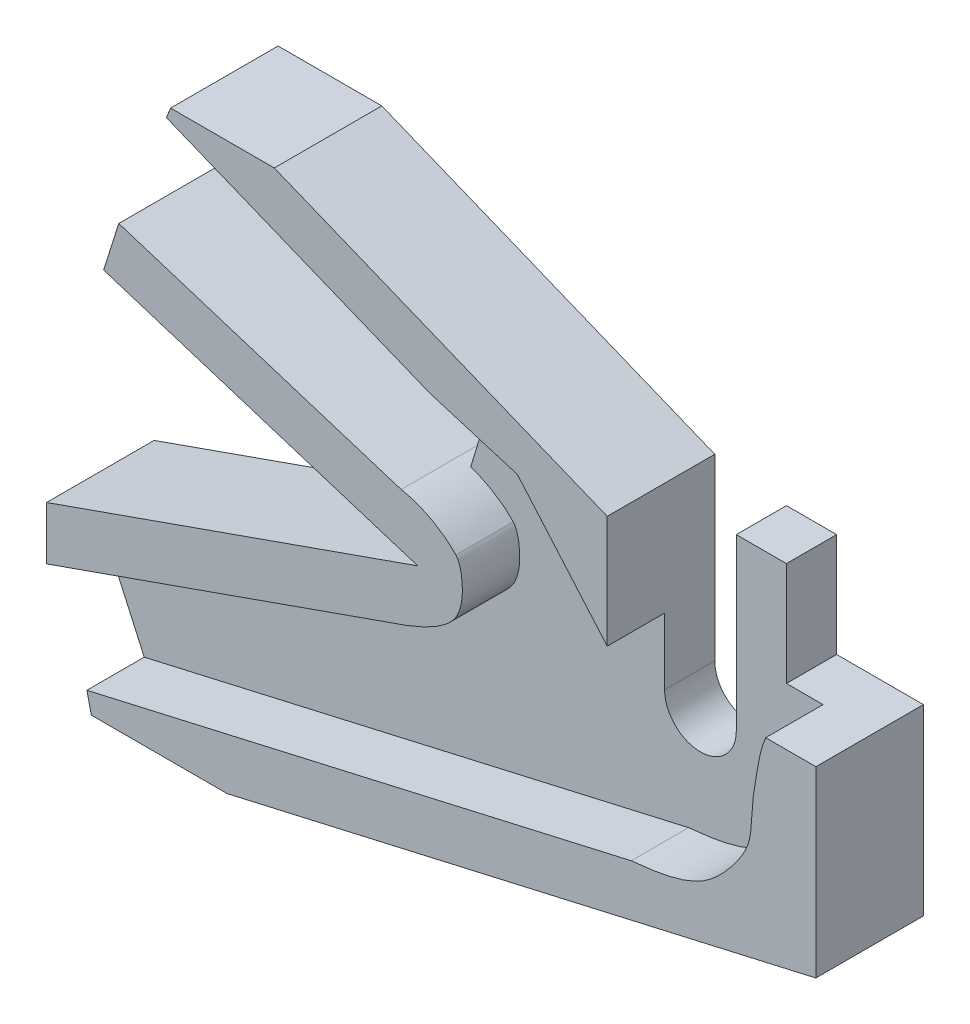
ISO-10303-21;
HEADER;
FILE_DESCRIPTION(('STEP AP214'),'2;1');
FILE_NAME('part.step','',(''),(''),'','','');
FILE_SCHEMA(('AUTOMOTIVE_DESIGN { 1 0 10303 214 1 1 1 1 }'));
ENDSEC;
DATA;
#1=APPLICATION_CONTEXT('core data for automotive mechanical design processes');
#2=APPLICATION_PROTOCOL_DEFINITION('international standard','automotive_design',2000,#1);
#3=PRODUCT_CONTEXT('',#1,'mechanical');
#4=PRODUCT('Part','Part','',(#3));
#5=PRODUCT_RELATED_PRODUCT_CATEGORY('part','',(#4));
#6=PRODUCT_DEFINITION_FORMATION('','',#4);
#7=PRODUCT_DEFINITION_CONTEXT('part definition',#1,'design');
#8=PRODUCT_DEFINITION('design','',#6,#7);
#9=PRODUCT_DEFINITION_SHAPE('','',#8);
#10=(LENGTH_UNIT() NAMED_UNIT(*) SI_UNIT(.MILLI.,.METRE.));
#11=(NAMED_UNIT(*) PLANE_ANGLE_UNIT() SI_UNIT($,.RADIAN.));
#12=(NAMED_UNIT(*) SI_UNIT($,.STERADIAN.) SOLID_ANGLE_UNIT());
#13=UNCERTAINTY_MEASURE_WITH_UNIT(LENGTH_MEASURE(1.E-05),#10,'distance_accuracy_value','');
#14=(GEOMETRIC_REPRESENTATION_CONTEXT(3) GLOBAL_UNCERTAINTY_ASSIGNED_CONTEXT((#13)) GLOBAL_UNIT_ASSIGNED_CONTEXT((#10,
#11,#12)) REPRESENTATION_CONTEXT('',''));
#15=CARTESIAN_POINT('',(0.,0.,0.));
#16=DIRECTION('',(0.,0.,1.));
#17=DIRECTION('',(1.,0.,0.));
#18=AXIS2_PLACEMENT_3D('',#15,#16,#17);
#19=CARTESIAN_POINT('',(0.,0.,7.));
#20=DIRECTION('',(0.,0.,1.));
#21=DIRECTION('',(1.,0.,0.));
#22=AXIS2_PLACEMENT_3D('',#19,#20,#21);
#23=PLANE('',#22);
#24=CARTESIAN_POINT('',(114.251338293482,139.122057434541,7.));
#25=CARTESIAN_POINT('',(117.630269235792,139.451745498885,7.));
#26=CARTESIAN_POINT('',(123.500637096052,140.17650562535,7.));
#27=CARTESIAN_POINT('',(128.302839898139,145.268019155865,7.));
#28=CARTESIAN_POINT('',(131.110589528849,149.496362437343,7.));
#29=CARTESIAN_POINT('',(130.976085883031,154.112704048557,7.));
#30=CARTESIAN_POINT('',(131.81351493928,158.698679076612,7.));
#31=CARTESIAN_POINT('',(132.292264245439,161.793379253052,7.));
#32=CARTESIAN_POINT('',(133.003068168719,163.363718021564,7.));
#33=B_SPLINE_CURVE_WITH_KNOTS('',3,(#24,#25,#26,#27,#28,#29,#30,#31,#32),.UNSPECIFIED.,.F.,.F.,
(4,1,1,1,1,1,4),(0.,0.304997778392759,0.465583156579805,0.594531521816844,0.730666825485798,
0.852303270571424,1.),.UNSPECIFIED.);
#34=CARTESIAN_POINT('',(133.003068168719,163.363718021564,7.));
#35=VERTEX_POINT('',#34);
#36=CARTESIAN_POINT('',(114.251338293482,139.122057434541,7.));
#37=VERTEX_POINT('',#36);
#38=EDGE_CURVE('E409',#35,#37,#33,.F.);
#39=ORIENTED_EDGE('',*,*,#38,.F.);
#40=DIRECTION('',(1.,0.,0.));
#41=VECTOR('',#40,1.);
#42=CARTESIAN_POINT('',(0.,163.363718021564,7.));
#43=LINE('',#42,#41);
#44=CARTESIAN_POINT('',(127.895456025362,163.363718021564,7.));
#45=VERTEX_POINT('',#44);
#46=EDGE_CURVE('E668',#45,#35,#43,.T.);
#47=ORIENTED_EDGE('',*,*,#46,.F.);
#48=DIRECTION('',(0.,-1.,0.));
#49=VECTOR('',#48,1.);
#50=CARTESIAN_POINT('',(127.895456025362,0.,7.));
#51=LINE('',#50,#49);
#52=CARTESIAN_POINT('',(127.895456025362,177.847108131035,7.));
#53=VERTEX_POINT('',#52);
#54=EDGE_CURVE('E672',#53,#45,#51,.T.);
#55=ORIENTED_EDGE('',*,*,#54,.F.);
#56=DIRECTION('',(1.,0.,0.));
#57=VECTOR('',#56,1.);
#58=CARTESIAN_POINT('',(0.,177.847108131035,7.));
#59=LINE('',#58,#57);
#60=CARTESIAN_POINT('',(120.895456025362,177.847108131035,7.));
#61=VERTEX_POINT('',#60);
#62=EDGE_CURVE('E676',#61,#53,#59,.T.);
#63=ORIENTED_EDGE('',*,*,#62,.F.);
#64=DIRECTION('',(0.,-1.,0.));
#65=VECTOR('',#64,1.);
#66=CARTESIAN_POINT('',(120.895456025362,0.,7.));
#67=LINE('',#66,#65);
#68=CARTESIAN_POINT('',(120.895456025362,154.100245398849,7.));
#69=VERTEX_POINT('',#68);
#70=EDGE_CURVE('E680',#61,#69,#67,.T.);
#71=ORIENTED_EDGE('',*,*,#70,.T.);
#72=CARTESIAN_POINT('',(115.895456025362,154.100245398849,7.));
#73=DIRECTION('',(0.,0.,1.));
#74=DIRECTION('',(1.,0.,0.));
#75=AXIS2_PLACEMENT_3D('',#72,#73,#74);
#76=CIRCLE('',#75,5.00000000000001);
#77=CARTESIAN_POINT('',(110.895456025362,154.100245398849,7.));
#78=VERTEX_POINT('',#77);
#79=EDGE_CURVE('E683',#78,#69,#76,.T.);
#80=ORIENTED_EDGE('',*,*,#79,.F.);
#81=DIRECTION('',(0.,1.,0.));
#82=VECTOR('',#81,1.);
#83=CARTESIAN_POINT('',(110.895456025362,0.,7.));
#84=LINE('',#83,#82);
#85=CARTESIAN_POINT('',(110.895456025362,163.363718021564,7.));
#86=VERTEX_POINT('',#85);
#87=EDGE_CURVE('E687',#78,#86,#84,.T.);
#88=ORIENTED_EDGE('',*,*,#87,.T.);
#89=DIRECTION('',(-0.654208958328494,0.756313849432064,0.));
#90=VECTOR('',#89,1.);
#91=CARTESIAN_POINT('',(144.263672885915,124.787596094146,7.));
#92=LINE('',#91,#90);
#93=CARTESIAN_POINT('',(98.3673718659907,177.847108131035,7.));
#94=VERTEX_POINT('',#93);
#95=EDGE_CURVE('E498',#86,#94,#92,.T.);
#96=ORIENTED_EDGE('',*,*,#95,.T.);
#97=DIRECTION('',(-0.956955139782985,0.290235870358795,0.));
#98=VECTOR('',#97,1.);
#99=CARTESIAN_POINT('',(57.6818959785968,190.186646333231,7.));
#100=LINE('',#99,#98);
#101=CARTESIAN_POINT('',(87.9461166445004,181.007780929267,7.));
#102=VERTEX_POINT('',#101);
#103=EDGE_CURVE('E502',#94,#102,#100,.T.);
#104=ORIENTED_EDGE('',*,*,#103,.T.);
#105=DIRECTION('',(0.290235870358796,0.956955139782985,0.));
#106=VECTOR('',#105,1.);
#107=CARTESIAN_POINT('',(30.2642206659035,-9.17886540396356,7.));
#108=LINE('',#107,#106);
#109=CARTESIAN_POINT('',(83.8500527942316,167.502388403015,7.));
#110=VERTEX_POINT('',#109);
#111=EDGE_CURVE('E659',#110,#102,#108,.T.);
#112=ORIENTED_EDGE('',*,*,#111,.F.);
#113=CARTESIAN_POINT('',(89.7840653023184,163.822842658835,7.));
#114=CARTESIAN_POINT('',(89.3163299489595,164.268991094698,7.));
#115=CARTESIAN_POINT('',(88.7283822379727,164.883230811065,7.));
#116=CARTESIAN_POINT('',(87.4686049663665,165.75600214993,7.));
#117=CARTESIAN_POINT('',(86.0540993608297,166.664417976423,7.));
#118=CARTESIAN_POINT('',(84.5544661102407,167.244470402787,7.));
#119=CARTESIAN_POINT('',(83.4087406485989,167.666166331298,7.));
#120=CARTESIAN_POINT('',(82.6000325140046,167.827100908995,7.));
#121=CARTESIAN_POINT('',(82.1516733766683,167.921017401913,7.));
#122=B_SPLINE_CURVE_WITH_KNOTS('',3,(#113,#114,#115,#116,#117,#118,#119,#120,#121),
.UNSPECIFIED.,.F.,.F.,(4,1,1,1,1,1,4),(0.,0.219202804866936,0.269709764380204,0.505069595132677,
0.769616283167278,0.819109323654011,1.),.UNSPECIFIED.);
#123=CARTESIAN_POINT('',(89.7840653023184,163.822842658835,7.));
#124=VERTEX_POINT('',#123);
#125=EDGE_CURVE('E697',#110,#124,#122,.F.);
#126=ORIENTED_EDGE('',*,*,#125,.T.);
#127=CARTESIAN_POINT('',(79.225262092158,150.588845560685,7.));
#128=CARTESIAN_POINT('',(82.7046243559138,151.726727244382,7.));
#129=CARTESIAN_POINT('',(85.4752498126349,152.810317387559,7.));
#130=CARTESIAN_POINT('',(88.1909730080847,154.560214514461,7.));
#131=CARTESIAN_POINT('',(89.2301936255335,155.455562887182,7.));
#132=CARTESIAN_POINT('',(90.3085174006555,157.110254117227,7.));
#133=CARTESIAN_POINT('',(90.7141098676327,158.947185872426,7.));
#134=CARTESIAN_POINT('',(90.6377143369345,162.884305981463,7.));
#135=CARTESIAN_POINT('',(89.9243233059966,163.657833242743,7.));
#136=CARTESIAN_POINT('',(89.7840653023184,163.822842658835,7.));
#137=B_SPLINE_CURVE_WITH_KNOTS('',3,(#127,#128,#129,#130,#131,#132,#133,#134,#135,#136),
.UNSPECIFIED.,.F.,.F.,(4,1,1,1,1,1,1,4),(0.,0.252456108640945,0.293916012906438,
0.401189817127325,0.430118649039364,0.554275500114791,0.612815595849297,1.),.UNSPECIFIED.);
#138=CARTESIAN_POINT('',(79.225262092158,150.588845560685,7.));
#139=VERTEX_POINT('',#138);
#140=EDGE_CURVE('E879',#124,#139,#137,.F.);
#141=ORIENTED_EDGE('',*,*,#140,.T.);
#142=DIRECTION('',(0.94323670859298,0.332121230219753,0.));
#143=VECTOR('',#142,1.);
#144=CARTESIAN_POINT('',(-38.43590359074,109.159402940723,7.));
#145=LINE('',#144,#143);
#146=CARTESIAN_POINT('',(32.6823451226157,134.20071021659,7.));
#147=VERTEX_POINT('',#146);
#148=EDGE_CURVE('E871',#147,#139,#145,.T.);
#149=ORIENTED_EDGE('',*,*,#148,.F.);
#150=DIRECTION('',(-0.411644510354824,0.911344499678764,0.));
#151=VECTOR('',#150,1.);
#152=CARTESIAN_POINT('',(77.489673542484,35.0012522533407,7.));
#153=LINE('',#152,#151);
#154=CARTESIAN_POINT('',(38.3074852622428,121.747147987007,7.));
#155=VERTEX_POINT('',#154);
#156=EDGE_CURVE('E661',#155,#147,#153,.T.);
#157=ORIENTED_EDGE('',*,*,#156,.F.);
#158=DIRECTION('',(-0.974812997221088,-0.223023811394298,0.));
#159=VECTOR('',#158,1.);
#160=CARTESIAN_POINT('',(-24.5632227735133,107.363194376248,7.));
#161=LINE('',#160,#159);
#162=EDGE_CURVE('E414',#37,#155,#161,.T.);
#163=ORIENTED_EDGE('',*,*,#162,.F.);
#164=EDGE_LOOP('',(#39,#47,#55,#63,#71,#80,#88,#96,#104,#112,#126,#141,#149,#157,#163));
#165=FACE_BOUND('',#164,.T.);
#166=ADVANCED_FACE('F203',(#165),#23,.T.);
#167=CARTESIAN_POINT('',(30.2642206659035,-9.17886540396356,7.));
#168=DIRECTION('',(-0.956955139782985,0.290235870358796,0.));
#169=DIRECTION('',(-0.290235870358796,-0.956955139782985,0.));
#170=AXIS2_PLACEMENT_3D('',#167,#168,#169);
#171=PLANE('',#170);
#172=DIRECTION('',(0.290235870358796,0.956955139782985,0.));
#173=VECTOR('',#172,1.);
#174=CARTESIAN_POINT('',(30.2642206659035,-9.17886540396356,0.));
#175=LINE('',#174,#173);
#176=CARTESIAN_POINT('',(83.8500527942316,167.502388403015,0.));
#177=VERTEX_POINT('',#176);
#178=CARTESIAN_POINT('',(87.9461166445004,181.007780929267,0.));
#179=VERTEX_POINT('',#178);
#180=EDGE_CURVE('E692',#177,#179,#175,.T.);
#181=ORIENTED_EDGE('',*,*,#180,.F.);
#182=DIRECTION('',(0.,0.,-1.));
#183=VECTOR('',#182,1.);
#184=CARTESIAN_POINT('',(83.8500527942316,167.502388403015,7.));
#185=LINE('',#184,#183);
#186=EDGE_CURVE('E12',#110,#177,#185,.T.);
#187=ORIENTED_EDGE('',*,*,#186,.F.);
#188=ORIENTED_EDGE('',*,*,#111,.T.);
#189=DIRECTION('',(0.,0.,-1.));
#190=VECTOR('',#189,1.);
#191=CARTESIAN_POINT('',(87.9461166445004,181.007780929267,7.));
#192=LINE('',#191,#190);
#193=EDGE_CURVE('E691',#102,#179,#192,.T.);
#194=ORIENTED_EDGE('',*,*,#193,.T.);
#195=EDGE_LOOP('',(#181,#187,#188,#194));
#196=FACE_BOUND('',#195,.T.);
#197=ADVANCED_FACE('F205',(#196),#171,.T.);
#198=CARTESIAN_POINT('',(89.7840653023184,163.822842658835,7.));
#199=CARTESIAN_POINT('',(89.3163299489595,164.268991094698,7.));
#200=CARTESIAN_POINT('',(88.7283822379727,164.883230811065,7.));
#201=CARTESIAN_POINT('',(87.4686049663665,165.75600214993,7.));
#202=CARTESIAN_POINT('',(86.0540993608297,166.664417976423,7.));
#203=CARTESIAN_POINT('',(84.5544661102407,167.244470402787,7.));
#204=CARTESIAN_POINT('',(83.4087406485989,167.666166331298,7.));
#205=CARTESIAN_POINT('',(82.6000325140046,167.827100908995,7.));
#206=CARTESIAN_POINT('',(82.1516733766683,167.921017401913,7.));
#207=B_SPLINE_CURVE_WITH_KNOTS('',3,(#198,#199,#200,#201,#202,#203,#204,#205,#206),
.UNSPECIFIED.,.F.,.F.,(4,1,1,1,1,1,4),(0.,0.219202804866936,0.269709764380204,0.505069595132677,
0.769616283167278,0.819109323654011,1.),.UNSPECIFIED.);
#208=DIRECTION('',(0.,0.,-1.));
#209=VECTOR('',#208,1.);
#210=SURFACE_OF_LINEAR_EXTRUSION('',#207,#209);
#211=CARTESIAN_POINT('',(89.7840653023184,163.822842658835,0.));
#212=CARTESIAN_POINT('',(89.3163299489595,164.268991094698,0.));
#213=CARTESIAN_POINT('',(88.7283822379727,164.883230811065,0.));
#214=CARTESIAN_POINT('',(87.4686049663665,165.75600214993,0.));
#215=CARTESIAN_POINT('',(86.0540993608297,166.664417976423,0.));
#216=CARTESIAN_POINT('',(84.5544661102407,167.244470402787,0.));
#217=CARTESIAN_POINT('',(83.4087406485989,167.666166331298,0.));
#218=CARTESIAN_POINT('',(82.6000325140046,167.827100908995,0.));
#219=CARTESIAN_POINT('',(82.1516733766683,167.921017401913,0.));
#220=B_SPLINE_CURVE_WITH_KNOTS('',3,(#211,#212,#213,#214,#215,#216,#217,#218,#219),
.UNSPECIFIED.,.F.,.F.,(4,1,1,1,1,1,4),(0.,0.219202804866936,0.269709764380204,0.505069595132677,
0.769616283167278,0.819109323654011,1.),.UNSPECIFIED.);
#221=CARTESIAN_POINT('',(82.1516733766683,167.921017401913,0.));
#222=VERTEX_POINT('',#221);
#223=EDGE_CURVE('E696',#177,#222,#220,.T.);
#224=ORIENTED_EDGE('',*,*,#223,.T.);
#225=DIRECTION('',(0.,0.,-1.));
#226=VECTOR('',#225,1.);
#227=CARTESIAN_POINT('',(82.1516733766683,167.921017401913,7.));
#228=LINE('',#227,#226);
#229=CARTESIAN_POINT('',(82.1516733766683,167.921017401913,15.));
#230=VERTEX_POINT('',#229);
#231=EDGE_CURVE('E213',#230,#222,#228,.T.);
#232=ORIENTED_EDGE('',*,*,#231,.F.);
#233=CARTESIAN_POINT('',(89.7840653023184,163.822842658835,15.));
#234=CARTESIAN_POINT('',(89.3163299489595,164.268991094698,15.));
#235=CARTESIAN_POINT('',(88.7283822379727,164.883230811065,15.));
#236=CARTESIAN_POINT('',(87.4686049663665,165.75600214993,15.));
#237=CARTESIAN_POINT('',(86.0540993608297,166.664417976423,15.));
#238=CARTESIAN_POINT('',(84.5544661102407,167.244470402787,15.));
#239=CARTESIAN_POINT('',(83.4087406485989,167.666166331298,15.));
#240=CARTESIAN_POINT('',(82.6000325140046,167.827100908995,15.));
#241=CARTESIAN_POINT('',(82.1516733766683,167.921017401913,15.));
#242=B_SPLINE_CURVE_WITH_KNOTS('',3,(#233,#234,#235,#236,#237,#238,#239,#240,#241),
.UNSPECIFIED.,.F.,.F.,(4,1,1,1,1,1,4),(0.,0.219202804866936,0.269709764380204,0.505069595132677,
0.769616283167278,0.819109323654011,1.),.UNSPECIFIED.);
#243=CARTESIAN_POINT('',(89.7840653023184,163.822842658835,15.));
#244=VERTEX_POINT('',#243);
#245=EDGE_CURVE('E505',#244,#230,#242,.T.);
#246=ORIENTED_EDGE('',*,*,#245,.F.);
#247=DIRECTION('',(0.,0.,-1.));
#248=VECTOR('',#247,1.);
#249=CARTESIAN_POINT('',(89.7840653023184,163.822842658835,15.));
#250=LINE('',#249,#248);
#251=EDGE_CURVE('E544',#244,#124,#250,.T.);
#252=ORIENTED_EDGE('',*,*,#251,.T.);
#253=ORIENTED_EDGE('',*,*,#125,.F.);
#254=ORIENTED_EDGE('',*,*,#186,.T.);
#255=EDGE_LOOP('',(#224,#232,#246,#252,#253,#254));
#256=FACE_BOUND('',#255,.T.);
#257=ADVANCED_FACE('F649',(#256),#210,.F.);
#258=CARTESIAN_POINT('',(55.6675821364115,176.284245333248,7.));
#259=DIRECTION('',(0.301125824816119,0.953584415575681,0.));
#260=DIRECTION('',(-0.953584415575681,0.301125824816119,0.));
#261=AXIS2_PLACEMENT_3D('',#258,#259,#260);
#262=PLANE('',#261);
#263=DIRECTION('',(0.953584415575681,-0.301125824816119,0.));
#264=VECTOR('',#263,1.);
#265=CARTESIAN_POINT('',(55.6675821364115,176.284245333248,0.));
#266=LINE('',#265,#264);
#267=CARTESIAN_POINT('',(42.7520398931628,180.362755056582,0.));
#268=VERTEX_POINT('',#267);
#269=EDGE_CURVE('E703',#268,#222,#266,.T.);
#270=ORIENTED_EDGE('',*,*,#269,.F.);
#271=DIRECTION('',(0.,0.,-1.));
#272=VECTOR('',#271,1.);
#273=CARTESIAN_POINT('',(42.7520398931628,180.362755056582,7.));
#274=LINE('',#273,#272);
#275=CARTESIAN_POINT('',(42.7520398931628,180.362755056582,15.));
#276=VERTEX_POINT('',#275);
#277=EDGE_CURVE('E849',#276,#268,#274,.T.);
#278=ORIENTED_EDGE('',*,*,#277,.F.);
#279=DIRECTION('',(0.953584415575681,-0.301125824816119,0.));
#280=VECTOR('',#279,1.);
#281=CARTESIAN_POINT('',(55.6675821364115,176.284245333248,15.));
#282=LINE('',#281,#280);
#283=EDGE_CURVE('E511',#276,#230,#282,.T.);
#284=ORIENTED_EDGE('',*,*,#283,.T.);
#285=ORIENTED_EDGE('',*,*,#231,.T.);
#286=EDGE_LOOP('',(#270,#278,#284,#285));
#287=FACE_BOUND('',#286,.T.);
#288=ADVANCED_FACE('F646',(#287),#262,.T.);
#289=CARTESIAN_POINT('',(-12.9155422432485,4.07850972333446,7.));
#290=DIRECTION('',(0.953584415575681,-0.301125824816118,0.));
#291=DIRECTION('',(0.301125824816118,0.953584415575681,0.));
#292=AXIS2_PLACEMENT_3D('',#289,#290,#291);
#293=PLANE('',#292);
#294=DIRECTION('',(-0.301125824816118,-0.953584415575681,0.));
#295=VECTOR('',#294,1.);
#296=CARTESIAN_POINT('',(-12.9155422432485,4.07850972333446,0.));
#297=LINE('',#296,#295);
#298=CARTESIAN_POINT('',(40.64415911945,173.687664147552,0.));
#299=VERTEX_POINT('',#298);
#300=EDGE_CURVE('E710',#268,#299,#297,.T.);
#301=ORIENTED_EDGE('',*,*,#300,.T.);
#302=DIRECTION('',(0.,0.,-1.));
#303=VECTOR('',#302,1.);
#304=CARTESIAN_POINT('',(40.64415911945,173.687664147552,7.));
#305=LINE('',#304,#303);
#306=CARTESIAN_POINT('',(40.64415911945,173.687664147552,15.));
#307=VERTEX_POINT('',#306);
#308=EDGE_CURVE('E845',#307,#299,#305,.T.);
#309=ORIENTED_EDGE('',*,*,#308,.F.);
#310=DIRECTION('',(-0.301125824816118,-0.953584415575681,0.));
#311=VECTOR('',#310,1.);
#312=CARTESIAN_POINT('',(-12.9155422432485,4.07850972333446,15.));
#313=LINE('',#312,#311);
#314=EDGE_CURVE('E518',#276,#307,#313,.T.);
#315=ORIENTED_EDGE('',*,*,#314,.F.);
#316=ORIENTED_EDGE('',*,*,#277,.T.);
#317=EDGE_LOOP('',(#301,#309,#315,#316));
#318=FACE_BOUND('',#317,.T.);
#319=ADVANCED_FACE('F642',(#318),#293,.F.);
#320=CARTESIAN_POINT('',(53.5597013626985,169.609154424218,7.));
#321=DIRECTION('',(0.301125824816118,0.953584415575681,0.));
#322=DIRECTION('',(-0.953584415575681,0.301125824816118,0.));
#323=AXIS2_PLACEMENT_3D('',#320,#321,#322);
#324=PLANE('',#323);
#325=DIRECTION('',(0.953584415575681,-0.301125824816118,0.));
#326=VECTOR('',#325,1.);
#327=CARTESIAN_POINT('',(53.5597013626985,169.609154424218,0.));
#328=LINE('',#327,#326);
#329=CARTESIAN_POINT('',(84.4571090931259,159.852275813856,0.));
#330=VERTEX_POINT('',#329);
#331=EDGE_CURVE('E713',#299,#330,#328,.T.);
#332=ORIENTED_EDGE('',*,*,#331,.T.);
#333=DIRECTION('',(0.,0.,-1.));
#334=VECTOR('',#333,1.);
#335=CARTESIAN_POINT('',(84.4571090931259,159.852275813856,7.));
#336=LINE('',#335,#334);
#337=CARTESIAN_POINT('',(84.4571090931259,159.852275813856,15.));
#338=VERTEX_POINT('',#337);
#339=EDGE_CURVE('E842',#338,#330,#336,.T.);
#340=ORIENTED_EDGE('',*,*,#339,.F.);
#341=DIRECTION('',(0.953584415575681,-0.301125824816118,0.));
#342=VECTOR('',#341,1.);
#343=CARTESIAN_POINT('',(53.5597013626985,169.609154424218,15.));
#344=LINE('',#343,#342);
#345=EDGE_CURVE('E522',#307,#338,#344,.T.);
#346=ORIENTED_EDGE('',*,*,#345,.F.);
#347=ORIENTED_EDGE('',*,*,#308,.T.);
#348=EDGE_LOOP('',(#332,#340,#346,#347));
#349=FACE_BOUND('',#348,.T.);
#350=ADVANCED_FACE('F638',(#349),#324,.F.);
#351=CARTESIAN_POINT('',(-40.7607522022779,115.762059900873,7.));
#352=DIRECTION('',(-0.332121230219753,0.94323670859298,0.));
#353=DIRECTION('',(-0.94323670859298,-0.332121230219753,0.));
#354=AXIS2_PLACEMENT_3D('',#351,#352,#353);
#355=PLANE('',#354);
#356=DIRECTION('',(0.94323670859298,0.332121230219753,0.));
#357=VECTOR('',#356,1.);
#358=CARTESIAN_POINT('',(-40.7607522022779,115.762059900873,0.));
#359=LINE('',#358,#357);
#360=CARTESIAN_POINT('',(32.6823451226157,141.621965068345,0.));
#361=VERTEX_POINT('',#360);
#362=EDGE_CURVE('E717',#361,#330,#359,.T.);
#363=ORIENTED_EDGE('',*,*,#362,.F.);
#364=DIRECTION('',(0.,0.,-1.));
#365=VECTOR('',#364,1.);
#366=CARTESIAN_POINT('',(32.6823451226157,141.621965068345,7.));
#367=LINE('',#366,#365);
#368=CARTESIAN_POINT('',(32.6823451226157,141.621965068345,15.));
#369=VERTEX_POINT('',#368);
#370=EDGE_CURVE('E839',#369,#361,#367,.T.);
#371=ORIENTED_EDGE('',*,*,#370,.F.);
#372=DIRECTION('',(0.94323670859298,0.332121230219753,0.));
#373=VECTOR('',#372,1.);
#374=CARTESIAN_POINT('',(-40.7607522022779,115.762059900873,15.));
#375=LINE('',#374,#373);
#376=EDGE_CURVE('E526',#369,#338,#375,.T.);
#377=ORIENTED_EDGE('',*,*,#376,.T.);
#378=ORIENTED_EDGE('',*,*,#339,.T.);
#379=EDGE_LOOP('',(#363,#371,#377,#378));
#380=FACE_BOUND('',#379,.T.);
#381=ADVANCED_FACE('F634',(#380),#355,.T.);
#382=CARTESIAN_POINT('',(32.6823451226157,0.,7.));
#383=DIRECTION('',(-1.,0.,0.));
#384=DIRECTION('',(0.,0.,1.));
#385=AXIS2_PLACEMENT_3D('',#382,#383,#384);
#386=PLANE('',#385);
#387=DIRECTION('',(0.,1.,0.));
#388=VECTOR('',#387,1.);
#389=CARTESIAN_POINT('',(32.6823451226157,0.,0.));
#390=LINE('',#389,#388);
#391=CARTESIAN_POINT('',(32.6823451226157,134.20071021659,0.));
#392=VERTEX_POINT('',#391);
#393=EDGE_CURVE('E721',#392,#361,#390,.T.);
#394=ORIENTED_EDGE('',*,*,#393,.F.);
#395=DIRECTION('',(0.,0.,-1.));
#396=VECTOR('',#395,1.);
#397=CARTESIAN_POINT('',(32.6823451226157,134.20071021659,7.));
#398=LINE('',#397,#396);
#399=EDGE_CURVE('E836',#147,#392,#398,.T.);
#400=ORIENTED_EDGE('',*,*,#399,.F.);
#401=DIRECTION('',(0.,0.,-1.));
#402=VECTOR('',#401,1.);
#403=CARTESIAN_POINT('',(32.6823451226157,134.20071021659,15.));
#404=LINE('',#403,#402);
#405=CARTESIAN_POINT('',(32.6823451226157,134.20071021659,15.));
#406=VERTEX_POINT('',#405);
#407=EDGE_CURVE('E868',#406,#147,#404,.T.);
#408=ORIENTED_EDGE('',*,*,#407,.F.);
#409=DIRECTION('',(0.,1.,0.));
#410=VECTOR('',#409,1.);
#411=CARTESIAN_POINT('',(32.6823451226157,0.,15.));
#412=LINE('',#411,#410);
#413=EDGE_CURVE('E530',#406,#369,#412,.T.);
#414=ORIENTED_EDGE('',*,*,#413,.T.);
#415=ORIENTED_EDGE('',*,*,#370,.T.);
#416=EDGE_LOOP('',(#394,#400,#408,#414,#415));
#417=FACE_BOUND('',#416,.T.);
#418=ADVANCED_FACE('F630',(#417),#386,.T.);
#419=CARTESIAN_POINT('',(77.489673542484,35.0012522533407,7.));
#420=DIRECTION('',(-0.911344499678764,-0.411644510354824,0.));
#421=DIRECTION('',(0.411644510354824,-0.911344499678765,0.));
#422=AXIS2_PLACEMENT_3D('',#419,#420,#421);
#423=PLANE('',#422);
#424=DIRECTION('',(-0.411644510354824,0.911344499678764,0.));
#425=VECTOR('',#424,1.);
#426=CARTESIAN_POINT('',(77.489673542484,35.0012522533407,0.));
#427=LINE('',#426,#425);
#428=CARTESIAN_POINT('',(38.3074852622428,121.747147987007,0.));
#429=VERTEX_POINT('',#428);
#430=EDGE_CURVE('E725',#429,#392,#427,.T.);
#431=ORIENTED_EDGE('',*,*,#430,.F.);
#432=DIRECTION('',(0.,0.,-1.));
#433=VECTOR('',#432,1.);
#434=CARTESIAN_POINT('',(38.3074852622428,121.747147987007,7.));
#435=LINE('',#434,#433);
#436=EDGE_CURVE('E833',#155,#429,#435,.T.);
#437=ORIENTED_EDGE('',*,*,#436,.F.);
#438=ORIENTED_EDGE('',*,*,#156,.T.);
#439=ORIENTED_EDGE('',*,*,#399,.T.);
#440=EDGE_LOOP('',(#431,#437,#438,#439));
#441=FACE_BOUND('',#440,.T.);
#442=ADVANCED_FACE('F626',(#441),#423,.T.);
#443=CARTESIAN_POINT('',(62.8707080357562,14.3839536107584,7.));
#444=DIRECTION('',(0.974812997221088,0.223023811394299,0.));
#445=DIRECTION('',(-0.223023811394299,0.974812997221088,0.));
#446=AXIS2_PLACEMENT_3D('',#443,#444,#445);
#447=PLANE('',#446);
#448=DIRECTION('',(0.223023811394299,-0.974812997221088,0.));
#449=VECTOR('',#448,1.);
#450=CARTESIAN_POINT('',(62.8707080357562,14.3839536107584,0.));
#451=LINE('',#450,#449);
#452=CARTESIAN_POINT('',(38.9252807225665,119.04683074024,0.));
#453=VERTEX_POINT('',#452);
#454=EDGE_CURVE('E729',#429,#453,#451,.T.);
#455=ORIENTED_EDGE('',*,*,#454,.T.);
#456=DIRECTION('',(0.,0.,-1.));
#457=VECTOR('',#456,1.);
#458=CARTESIAN_POINT('',(38.9252807225665,119.04683074024,7.));
#459=LINE('',#458,#457);
#460=CARTESIAN_POINT('',(38.9252807225665,119.04683074024,15.));
#461=VERTEX_POINT('',#460);
#462=EDGE_CURVE('E829',#461,#453,#459,.T.);
#463=ORIENTED_EDGE('',*,*,#462,.F.);
#464=DIRECTION('',(0.223023811394299,-0.974812997221088,0.));
#465=VECTOR('',#464,1.);
#466=CARTESIAN_POINT('',(62.8707080357562,14.3839536107584,15.));
#467=LINE('',#466,#465);
#468=CARTESIAN_POINT('',(38.3074852622428,121.747147987007,15.));
#469=VERTEX_POINT('',#468);
#470=EDGE_CURVE('E431',#469,#461,#467,.T.);
#471=ORIENTED_EDGE('',*,*,#470,.F.);
#472=DIRECTION('',(0.,0.,-1.));
#473=VECTOR('',#472,1.);
#474=CARTESIAN_POINT('',(38.3074852622428,121.747147987007,15.));
#475=LINE('',#474,#473);
#476=EDGE_CURVE('E415',#469,#155,#475,.T.);
#477=ORIENTED_EDGE('',*,*,#476,.T.);
#478=ORIENTED_EDGE('',*,*,#436,.T.);
#479=EDGE_LOOP('',(#455,#463,#471,#477,#478));
#480=FACE_BOUND('',#479,.T.);
#481=ADVANCED_FACE('F622',(#480),#447,.F.);
#482=CARTESIAN_POINT('',(0.,119.04683074024,7.));
#483=DIRECTION('',(0.,1.,0.));
#484=DIRECTION('',(0.,0.,1.));
#485=AXIS2_PLACEMENT_3D('',#482,#483,#484);
#486=PLANE('',#485);
#487=DIRECTION('',(1.,0.,0.));
#488=VECTOR('',#487,1.);
#489=CARTESIAN_POINT('',(0.,119.04683074024,0.));
#490=LINE('',#489,#488);
#491=CARTESIAN_POINT('',(57.891473285429,119.04683074024,0.));
#492=VERTEX_POINT('',#491);
#493=EDGE_CURVE('E732',#453,#492,#490,.T.);
#494=ORIENTED_EDGE('',*,*,#493,.T.);
#495=DIRECTION('',(0.,0.,-1.));
#496=VECTOR('',#495,1.);
#497=CARTESIAN_POINT('',(57.891473285429,119.04683074024,7.));
#498=LINE('',#497,#496);
#499=CARTESIAN_POINT('',(57.891473285429,119.04683074024,15.));
#500=VERTEX_POINT('',#499);
#501=EDGE_CURVE('E825',#500,#492,#498,.T.);
#502=ORIENTED_EDGE('',*,*,#501,.F.);
#503=DIRECTION('',(1.,0.,0.));
#504=VECTOR('',#503,1.);
#505=CARTESIAN_POINT('',(0.,119.04683074024,15.));
#506=LINE('',#505,#504);
#507=EDGE_CURVE('E434',#461,#500,#506,.T.);
#508=ORIENTED_EDGE('',*,*,#507,.F.);
#509=ORIENTED_EDGE('',*,*,#462,.T.);
#510=EDGE_LOOP('',(#494,#502,#508,#509));
#511=FACE_BOUND('',#510,.T.);
#512=ADVANCED_FACE('F618',(#511),#486,.F.);
#513=CARTESIAN_POINT('',(-23.0020560937533,100.539503395701,7.));
#514=DIRECTION('',(-0.223023811394299,0.974812997221088,0.));
#515=DIRECTION('',(-0.974812997221088,-0.223023811394299,0.));
#516=AXIS2_PLACEMENT_3D('',#513,#514,#515);
#517=PLANE('',#516);
#518=DIRECTION('',(0.974812997221088,0.223023811394299,0.));
#519=VECTOR('',#518,1.);
#520=CARTESIAN_POINT('',(-23.0020560937533,100.539503395701,0.));
#521=LINE('',#520,#519);
#522=CARTESIAN_POINT('',(140.003068168719,137.832834725353,0.));
#523=VERTEX_POINT('',#522);
#524=EDGE_CURVE('E735',#492,#523,#521,.T.);
#525=ORIENTED_EDGE('',*,*,#524,.T.);
#526=DIRECTION('',(0.,0.,-1.));
#527=VECTOR('',#526,1.);
#528=CARTESIAN_POINT('',(140.003068168719,137.832834725353,7.));
#529=LINE('',#528,#527);
#530=CARTESIAN_POINT('',(140.003068168719,137.832834725353,15.));
#531=VERTEX_POINT('',#530);
#532=EDGE_CURVE('E821',#531,#523,#529,.T.);
#533=ORIENTED_EDGE('',*,*,#532,.F.);
#534=DIRECTION('',(0.974812997221088,0.223023811394299,0.));
#535=VECTOR('',#534,1.);
#536=CARTESIAN_POINT('',(-23.0020560937533,100.539503395701,15.));
#537=LINE('',#536,#535);
#538=EDGE_CURVE('E443',#500,#531,#537,.T.);
#539=ORIENTED_EDGE('',*,*,#538,.F.);
#540=ORIENTED_EDGE('',*,*,#501,.T.);
#541=EDGE_LOOP('',(#525,#533,#539,#540));
#542=FACE_BOUND('',#541,.T.);
#543=ADVANCED_FACE('F614',(#542),#517,.F.);
#544=CARTESIAN_POINT('',(140.003068168719,0.,7.));
#545=DIRECTION('',(-1.,0.,0.));
#546=DIRECTION('',(0.,0.,1.));
#547=AXIS2_PLACEMENT_3D('',#544,#545,#546);
#548=PLANE('',#547);
#549=DIRECTION('',(0.,1.,0.));
#550=VECTOR('',#549,1.);
#551=CARTESIAN_POINT('',(140.003068168719,0.,0.));
#552=LINE('',#551,#550);
#553=CARTESIAN_POINT('',(140.003068168719,163.363718021564,0.));
#554=VERTEX_POINT('',#553);
#555=EDGE_CURVE('E738',#523,#554,#552,.T.);
#556=ORIENTED_EDGE('',*,*,#555,.T.);
#557=DIRECTION('',(0.,0.,-1.));
#558=VECTOR('',#557,1.);
#559=CARTESIAN_POINT('',(140.003068168719,163.363718021564,7.));
#560=LINE('',#559,#558);
#561=CARTESIAN_POINT('',(140.003068168719,163.363718021564,15.));
#562=VERTEX_POINT('',#561);
#563=EDGE_CURVE('E817',#562,#554,#560,.T.);
#564=ORIENTED_EDGE('',*,*,#563,.F.);
#565=DIRECTION('',(0.,1.,0.));
#566=VECTOR('',#565,1.);
#567=CARTESIAN_POINT('',(140.003068168719,0.,15.));
#568=LINE('',#567,#566);
#569=EDGE_CURVE('E447',#531,#562,#568,.T.);
#570=ORIENTED_EDGE('',*,*,#569,.F.);
#571=ORIENTED_EDGE('',*,*,#532,.T.);
#572=EDGE_LOOP('',(#556,#564,#570,#571));
#573=FACE_BOUND('',#572,.T.);
#574=ADVANCED_FACE('F610',(#573),#548,.F.);
#575=CARTESIAN_POINT('',(0.,163.363718021564,7.));
#576=DIRECTION('',(0.,1.,0.));
#577=DIRECTION('',(0.,0.,1.));
#578=AXIS2_PLACEMENT_3D('',#575,#576,#577);
#579=PLANE('',#578);
#580=ORIENTED_EDGE('',*,*,#46,.T.);
#581=DIRECTION('',(0.,0.,-1.));
#582=VECTOR('',#581,1.);
#583=CARTESIAN_POINT('',(133.003068168719,163.363718021564,15.));
#584=LINE('',#583,#582);
#585=CARTESIAN_POINT('',(133.003068168719,163.363718021564,15.));
#586=VERTEX_POINT('',#585);
#587=EDGE_CURVE('E452',#586,#35,#584,.T.);
#588=ORIENTED_EDGE('',*,*,#587,.F.);
#589=DIRECTION('',(1.,0.,0.));
#590=VECTOR('',#589,1.);
#591=CARTESIAN_POINT('',(0.,163.363718021564,15.));
#592=LINE('',#591,#590);
#593=EDGE_CURVE('E424',#586,#562,#592,.T.);
#594=ORIENTED_EDGE('',*,*,#593,.T.);
#595=ORIENTED_EDGE('',*,*,#563,.T.);
#596=DIRECTION('',(1.,0.,0.));
#597=VECTOR('',#596,1.);
#598=CARTESIAN_POINT('',(0.,163.363718021564,0.));
#599=LINE('',#598,#597);
#600=CARTESIAN_POINT('',(127.895456025362,163.363718021564,0.));
#601=VERTEX_POINT('',#600);
#602=EDGE_CURVE('E742',#601,#554,#599,.T.);
#603=ORIENTED_EDGE('',*,*,#602,.F.);
#604=DIRECTION('',(0.,0.,-1.));
#605=VECTOR('',#604,1.);
#606=CARTESIAN_POINT('',(127.895456025362,163.363718021564,7.));
#607=LINE('',#606,#605);
#608=EDGE_CURVE('E814',#45,#601,#607,.T.);
#609=ORIENTED_EDGE('',*,*,#608,.F.);
#610=EDGE_LOOP('',(#580,#588,#594,#595,#603,#609));
#611=FACE_BOUND('',#610,.T.);
#612=ADVANCED_FACE('F606',(#611),#579,.T.);
#613=CARTESIAN_POINT('',(127.895456025362,0.,7.));
#614=DIRECTION('',(1.,0.,0.));
#615=DIRECTION('',(0.,0.,-1.));
#616=AXIS2_PLACEMENT_3D('',#613,#614,#615);
#617=PLANE('',#616);
#618=DIRECTION('',(0.,-1.,0.));
#619=VECTOR('',#618,1.);
#620=CARTESIAN_POINT('',(127.895456025362,0.,0.));
#621=LINE('',#620,#619);
#622=CARTESIAN_POINT('',(127.895456025362,177.847108131035,0.));
#623=VERTEX_POINT('',#622);
#624=EDGE_CURVE('E745',#623,#601,#621,.T.);
#625=ORIENTED_EDGE('',*,*,#624,.F.);
#626=DIRECTION('',(0.,0.,-1.));
#627=VECTOR('',#626,1.);
#628=CARTESIAN_POINT('',(127.895456025362,177.847108131035,7.));
#629=LINE('',#628,#627);
#630=EDGE_CURVE('E811',#53,#623,#629,.T.);
#631=ORIENTED_EDGE('',*,*,#630,.F.);
#632=ORIENTED_EDGE('',*,*,#54,.T.);
#633=ORIENTED_EDGE('',*,*,#608,.T.);
#634=EDGE_LOOP('',(#625,#631,#632,#633));
#635=FACE_BOUND('',#634,.T.);
#636=ADVANCED_FACE('F602',(#635),#617,.T.);
#637=CARTESIAN_POINT('',(0.,177.847108131035,7.));
#638=DIRECTION('',(0.,1.,0.));
#639=DIRECTION('',(0.,0.,1.));
#640=AXIS2_PLACEMENT_3D('',#637,#638,#639);
#641=PLANE('',#640);
#642=DIRECTION('',(1.,0.,0.));
#643=VECTOR('',#642,1.);
#644=CARTESIAN_POINT('',(0.,177.847108131035,0.));
#645=LINE('',#644,#643);
#646=CARTESIAN_POINT('',(120.895456025362,177.847108131035,0.));
#647=VERTEX_POINT('',#646);
#648=EDGE_CURVE('E749',#647,#623,#645,.T.);
#649=ORIENTED_EDGE('',*,*,#648,.F.);
#650=DIRECTION('',(0.,0.,-1.));
#651=VECTOR('',#650,1.);
#652=CARTESIAN_POINT('',(120.895456025362,177.847108131035,7.));
#653=LINE('',#652,#651);
#654=EDGE_CURVE('E808',#61,#647,#653,.T.);
#655=ORIENTED_EDGE('',*,*,#654,.F.);
#656=ORIENTED_EDGE('',*,*,#62,.T.);
#657=ORIENTED_EDGE('',*,*,#630,.T.);
#658=EDGE_LOOP('',(#649,#655,#656,#657));
#659=FACE_BOUND('',#658,.T.);
#660=ADVANCED_FACE('F598',(#659),#641,.T.);
#661=CARTESIAN_POINT('',(120.895456025362,0.,7.));
#662=DIRECTION('',(1.,0.,0.));
#663=DIRECTION('',(0.,0.,-1.));
#664=AXIS2_PLACEMENT_3D('',#661,#662,#663);
#665=PLANE('',#664);
#666=DIRECTION('',(0.,-1.,0.));
#667=VECTOR('',#666,1.);
#668=CARTESIAN_POINT('',(120.895456025362,0.,0.));
#669=LINE('',#668,#667);
#670=CARTESIAN_POINT('',(120.895456025362,154.100245398849,0.));
#671=VERTEX_POINT('',#670);
#672=EDGE_CURVE('E753',#647,#671,#669,.T.);
#673=ORIENTED_EDGE('',*,*,#672,.T.);
#674=DIRECTION('',(0.,0.,-1.));
#675=VECTOR('',#674,1.);
#676=CARTESIAN_POINT('',(120.895456025362,154.100245398849,7.));
#677=LINE('',#676,#675);
#678=EDGE_CURVE('E805',#69,#671,#677,.T.);
#679=ORIENTED_EDGE('',*,*,#678,.F.);
#680=ORIENTED_EDGE('',*,*,#70,.F.);
#681=ORIENTED_EDGE('',*,*,#654,.T.);
#682=EDGE_LOOP('',(#673,#679,#680,#681));
#683=FACE_BOUND('',#682,.T.);
#684=ADVANCED_FACE('F594',(#683),#665,.F.);
#685=CARTESIAN_POINT('',(115.895456025362,154.100245398849,7.));
#686=DIRECTION('',(0.,0.,-1.));
#687=DIRECTION('',(-1.,0.,0.));
#688=AXIS2_PLACEMENT_3D('',#685,#686,#687);
#689=CYLINDRICAL_SURFACE('',#688,5.00000000000001);
#690=CARTESIAN_POINT('',(115.895456025362,154.100245398849,0.));
#691=DIRECTION('',(0.,0.,1.));
#692=DIRECTION('',(1.,0.,0.));
#693=AXIS2_PLACEMENT_3D('',#690,#691,#692);
#694=CIRCLE('',#693,5.00000000000001);
#695=CARTESIAN_POINT('',(110.895456025362,154.100245398849,0.));
#696=VERTEX_POINT('',#695);
#697=EDGE_CURVE('E757',#696,#671,#694,.T.);
#698=ORIENTED_EDGE('',*,*,#697,.F.);
#699=DIRECTION('',(0.,0.,-1.));
#700=VECTOR('',#699,1.);
#701=CARTESIAN_POINT('',(110.895456025362,154.100245398849,7.));
#702=LINE('',#701,#700);
#703=EDGE_CURVE('E802',#78,#696,#702,.T.);
#704=ORIENTED_EDGE('',*,*,#703,.F.);
#705=ORIENTED_EDGE('',*,*,#79,.T.);
#706=ORIENTED_EDGE('',*,*,#678,.T.);
#707=EDGE_LOOP('',(#698,#704,#705,#706));
#708=FACE_BOUND('',#707,.T.);
#709=ADVANCED_FACE('F590',(#708),#689,.F.);
#710=CARTESIAN_POINT('',(110.895456025362,0.,7.));
#711=DIRECTION('',(-1.,0.,0.));
#712=DIRECTION('',(0.,0.,1.));
#713=AXIS2_PLACEMENT_3D('',#710,#711,#712);
#714=PLANE('',#713);
#715=DIRECTION('',(0.,0.,-1.));
#716=VECTOR('',#715,1.);
#717=CARTESIAN_POINT('',(110.895456025362,179.055292265325,7.));
#718=LINE('',#717,#716);
#719=CARTESIAN_POINT('',(110.895456025362,179.055292265325,15.));
#720=VERTEX_POINT('',#719);
#721=CARTESIAN_POINT('',(110.895456025362,179.055292265325,0.));
#722=VERTEX_POINT('',#721);
#723=EDGE_CURVE('E798',#720,#722,#718,.T.);
#724=ORIENTED_EDGE('',*,*,#723,.F.);
#725=DIRECTION('',(0.,-1.,0.));
#726=VECTOR('',#725,1.);
#727=CARTESIAN_POINT('',(110.895456025362,0.,15.));
#728=LINE('',#727,#726);
#729=CARTESIAN_POINT('',(110.895456025362,163.363718021564,15.));
#730=VERTEX_POINT('',#729);
#731=EDGE_CURVE('E463',#720,#730,#728,.T.);
#732=ORIENTED_EDGE('',*,*,#731,.T.);
#733=DIRECTION('',(0.,0.,-1.));
#734=VECTOR('',#733,1.);
#735=CARTESIAN_POINT('',(110.895456025362,163.363718021564,15.));
#736=LINE('',#735,#734);
#737=EDGE_CURVE('E492',#730,#86,#736,.T.);
#738=ORIENTED_EDGE('',*,*,#737,.T.);
#739=ORIENTED_EDGE('',*,*,#87,.F.);
#740=ORIENTED_EDGE('',*,*,#703,.T.);
#741=DIRECTION('',(0.,1.,0.));
#742=VECTOR('',#741,1.);
#743=CARTESIAN_POINT('',(110.895456025362,0.,0.));
#744=LINE('',#743,#742);
#745=EDGE_CURVE('E761',#696,#722,#744,.T.);
#746=ORIENTED_EDGE('',*,*,#745,.T.);
#747=EDGE_LOOP('',(#724,#732,#738,#739,#740,#746));
#748=FACE_BOUND('',#747,.T.);
#749=ADVANCED_FACE('F586',(#748),#714,.F.);
#750=CARTESIAN_POINT('',(78.1143150610226,192.366723313486,7.));
#751=DIRECTION('',(0.376233726705469,0.926524788059831,0.));
#752=DIRECTION('',(-0.926524788059831,0.376233726705469,0.));
#753=AXIS2_PLACEMENT_3D('',#750,#751,#752);
#754=PLANE('',#753);
#755=DIRECTION('',(0.926524788059831,-0.376233726705469,0.));
#756=VECTOR('',#755,1.);
#757=CARTESIAN_POINT('',(78.1143150610226,192.366723313486,0.));
#758=LINE('',#757,#756);
#759=CARTESIAN_POINT('',(64.4465485576623,197.916790395952,0.));
#760=VERTEX_POINT('',#759);
#761=EDGE_CURVE('E764',#760,#722,#758,.T.);
#762=ORIENTED_EDGE('',*,*,#761,.F.);
#763=DIRECTION('',(0.,0.,-1.));
#764=VECTOR('',#763,1.);
#765=CARTESIAN_POINT('',(64.4465485576623,197.916790395952,7.));
#766=LINE('',#765,#764);
#767=CARTESIAN_POINT('',(64.4465485576623,197.916790395952,15.));
#768=VERTEX_POINT('',#767);
#769=EDGE_CURVE('E795',#768,#760,#766,.T.);
#770=ORIENTED_EDGE('',*,*,#769,.F.);
#771=DIRECTION('',(0.926524788059831,-0.376233726705469,0.));
#772=VECTOR('',#771,1.);
#773=CARTESIAN_POINT('',(78.1143150610226,192.366723313486,15.));
#774=LINE('',#773,#772);
#775=EDGE_CURVE('E470',#768,#720,#774,.T.);
#776=ORIENTED_EDGE('',*,*,#775,.T.);
#777=ORIENTED_EDGE('',*,*,#723,.T.);
#778=EDGE_LOOP('',(#762,#770,#776,#777));
#779=FACE_BOUND('',#778,.T.);
#780=ADVANCED_FACE('F582',(#779),#754,.T.);
#781=CARTESIAN_POINT('',(0.,197.916790395952,7.));
#782=DIRECTION('',(0.,1.,0.));
#783=DIRECTION('',(0.,0.,1.));
#784=AXIS2_PLACEMENT_3D('',#781,#782,#783);
#785=PLANE('',#784);
#786=DIRECTION('',(1.,0.,0.));
#787=VECTOR('',#786,1.);
#788=CARTESIAN_POINT('',(0.,197.916790395952,0.));
#789=LINE('',#788,#787);
#790=CARTESIAN_POINT('',(49.9782962822436,197.916790395952,0.));
#791=VERTEX_POINT('',#790);
#792=EDGE_CURVE('E768',#791,#760,#789,.T.);
#793=ORIENTED_EDGE('',*,*,#792,.F.);
#794=DIRECTION('',(0.,0.,-1.));
#795=VECTOR('',#794,1.);
#796=CARTESIAN_POINT('',(49.9782962822436,197.916790395952,7.));
#797=LINE('',#796,#795);
#798=CARTESIAN_POINT('',(49.9782962822436,197.916790395952,15.));
#799=VERTEX_POINT('',#798);
#800=EDGE_CURVE('E792',#799,#791,#797,.T.);
#801=ORIENTED_EDGE('',*,*,#800,.F.);
#802=DIRECTION('',(1.,0.,0.));
#803=VECTOR('',#802,1.);
#804=CARTESIAN_POINT('',(0.,197.916790395952,15.));
#805=LINE('',#804,#803);
#806=EDGE_CURVE('E474',#799,#768,#805,.T.);
#807=ORIENTED_EDGE('',*,*,#806,.T.);
#808=ORIENTED_EDGE('',*,*,#769,.T.);
#809=EDGE_LOOP('',(#793,#801,#807,#808));
#810=FACE_BOUND('',#809,.T.);
#811=ADVANCED_FACE('F578',(#810),#785,.T.);
#812=CARTESIAN_POINT('',(-26.0880113787776,10.5935533186602,7.));
#813=DIRECTION('',(-0.926524788059831,0.376233726705469,0.));
#814=DIRECTION('',(-0.376233726705469,-0.926524788059831,0.));
#815=AXIS2_PLACEMENT_3D('',#812,#813,#814);
#816=PLANE('',#815);
#817=DIRECTION('',(0.376233726705469,0.926524788059831,0.));
#818=VECTOR('',#817,1.);
#819=CARTESIAN_POINT('',(-26.0880113787776,10.5935533186602,0.));
#820=LINE('',#819,#818);
#821=CARTESIAN_POINT('',(49.3926675953067,196.474603115728,0.));
#822=VERTEX_POINT('',#821);
#823=EDGE_CURVE('E772',#822,#791,#820,.T.);
#824=ORIENTED_EDGE('',*,*,#823,.F.);
#825=DIRECTION('',(0.,0.,-1.));
#826=VECTOR('',#825,1.);
#827=CARTESIAN_POINT('',(49.3926675953067,196.474603115728,7.));
#828=LINE('',#827,#826);
#829=CARTESIAN_POINT('',(49.3926675953067,196.474603115728,15.));
#830=VERTEX_POINT('',#829);
#831=EDGE_CURVE('E789',#830,#822,#828,.T.);
#832=ORIENTED_EDGE('',*,*,#831,.F.);
#833=DIRECTION('',(0.376233726705469,0.926524788059831,0.));
#834=VECTOR('',#833,1.);
#835=CARTESIAN_POINT('',(-26.0880113787776,10.5935533186602,15.));
#836=LINE('',#835,#834);
#837=EDGE_CURVE('E478',#830,#799,#836,.T.);
#838=ORIENTED_EDGE('',*,*,#837,.T.);
#839=ORIENTED_EDGE('',*,*,#800,.T.);
#840=EDGE_LOOP('',(#824,#832,#838,#839));
#841=FACE_BOUND('',#840,.T.);
#842=ADVANCED_FACE('F574',(#841),#816,.T.);
#843=CARTESIAN_POINT('',(75.4806789740844,185.881049797068,7.));
#844=DIRECTION('',(0.37623372670547,0.926524788059831,0.));
#845=DIRECTION('',(-0.926524788059831,0.37623372670547,0.));
#846=AXIS2_PLACEMENT_3D('',#843,#844,#845);
#847=PLANE('',#846);
#848=DIRECTION('',(0.926524788059831,-0.37623372670547,0.));
#849=VECTOR('',#848,1.);
#850=CARTESIAN_POINT('',(75.4806789740844,185.881049797068,0.));
#851=LINE('',#850,#849);
#852=CARTESIAN_POINT('',(86.1114114971042,181.56423046715,0.));
#853=VERTEX_POINT('',#852);
#854=EDGE_CURVE('E776',#822,#853,#851,.T.);
#855=ORIENTED_EDGE('',*,*,#854,.T.);
#856=DIRECTION('',(0.,0.,-1.));
#857=VECTOR('',#856,1.);
#858=CARTESIAN_POINT('',(86.1114114971042,181.56423046715,7.));
#859=LINE('',#858,#857);
#860=CARTESIAN_POINT('',(86.1114114971042,181.56423046715,15.));
#861=VERTEX_POINT('',#860);
#862=EDGE_CURVE('E785',#861,#853,#859,.T.);
#863=ORIENTED_EDGE('',*,*,#862,.F.);
#864=DIRECTION('',(0.926524788059831,-0.37623372670547,0.));
#865=VECTOR('',#864,1.);
#866=CARTESIAN_POINT('',(75.4806789740844,185.881049797068,15.));
#867=LINE('',#866,#865);
#868=EDGE_CURVE('E482',#830,#861,#867,.T.);
#869=ORIENTED_EDGE('',*,*,#868,.F.);
#870=ORIENTED_EDGE('',*,*,#831,.T.);
#871=EDGE_LOOP('',(#855,#863,#869,#870));
#872=FACE_BOUND('',#871,.T.);
#873=ADVANCED_FACE('F570',(#872),#847,.F.);
#874=CARTESIAN_POINT('',(57.6818959785968,190.186646333231,7.));
#875=DIRECTION('',(0.290235870358795,0.956955139782985,0.));
#876=DIRECTION('',(-0.956955139782985,0.290235870358795,0.));
#877=AXIS2_PLACEMENT_3D('',#874,#875,#876);
#878=PLANE('',#877);
#879=DIRECTION('',(0.956955139782985,-0.290235870358795,0.));
#880=VECTOR('',#879,1.);
#881=CARTESIAN_POINT('',(57.6818959785968,190.186646333231,0.));
#882=LINE('',#881,#880);
#883=EDGE_CURVE('E779',#853,#179,#882,.T.);
#884=ORIENTED_EDGE('',*,*,#883,.T.);
#885=ORIENTED_EDGE('',*,*,#193,.F.);
#886=ORIENTED_EDGE('',*,*,#103,.F.);
#887=DIRECTION('',(0.,0.,-1.));
#888=VECTOR('',#887,1.);
#889=CARTESIAN_POINT('',(98.3673718659907,177.847108131035,15.));
#890=LINE('',#889,#888);
#891=CARTESIAN_POINT('',(98.3673718659907,177.847108131035,15.));
#892=VERTEX_POINT('',#891);
#893=EDGE_CURVE('E221',#892,#94,#890,.T.);
#894=ORIENTED_EDGE('',*,*,#893,.F.);
#895=DIRECTION('',(0.956955139782985,-0.290235870358795,0.));
#896=VECTOR('',#895,1.);
#897=CARTESIAN_POINT('',(57.6818959785968,190.186646333231,15.));
#898=LINE('',#897,#896);
#899=EDGE_CURVE('E486',#861,#892,#898,.T.);
#900=ORIENTED_EDGE('',*,*,#899,.F.);
#901=ORIENTED_EDGE('',*,*,#862,.T.);
#902=EDGE_LOOP('',(#884,#885,#886,#894,#900,#901));
#903=FACE_BOUND('',#902,.T.);
#904=ADVANCED_FACE('F566',(#903),#878,.F.);
#905=CARTESIAN_POINT('',(0.,0.,0.));
#906=DIRECTION('',(0.,0.,1.));
#907=DIRECTION('',(1.,0.,0.));
#908=AXIS2_PLACEMENT_3D('',#905,#906,#907);
#909=PLANE('',#908);
#910=ORIENTED_EDGE('',*,*,#602,.T.);
#911=ORIENTED_EDGE('',*,*,#555,.F.);
#912=ORIENTED_EDGE('',*,*,#524,.F.);
#913=ORIENTED_EDGE('',*,*,#493,.F.);
#914=ORIENTED_EDGE('',*,*,#454,.F.);
#915=ORIENTED_EDGE('',*,*,#430,.T.);
#916=ORIENTED_EDGE('',*,*,#393,.T.);
#917=ORIENTED_EDGE('',*,*,#362,.T.);
#918=ORIENTED_EDGE('',*,*,#331,.F.);
#919=ORIENTED_EDGE('',*,*,#300,.F.);
#920=ORIENTED_EDGE('',*,*,#269,.T.);
#921=ORIENTED_EDGE('',*,*,#223,.F.);
#922=ORIENTED_EDGE('',*,*,#180,.T.);
#923=ORIENTED_EDGE('',*,*,#883,.F.);
#924=ORIENTED_EDGE('',*,*,#854,.F.);
#925=ORIENTED_EDGE('',*,*,#823,.T.);
#926=ORIENTED_EDGE('',*,*,#792,.T.);
#927=ORIENTED_EDGE('',*,*,#761,.T.);
#928=ORIENTED_EDGE('',*,*,#745,.F.);
#929=ORIENTED_EDGE('',*,*,#697,.T.);
#930=ORIENTED_EDGE('',*,*,#672,.F.);
#931=ORIENTED_EDGE('',*,*,#648,.T.);
#932=ORIENTED_EDGE('',*,*,#624,.T.);
#933=EDGE_LOOP('',(#910,#911,#912,#913,#914,#915,#916,#917,#918,#919,#920,#921,#922,#923,#924,
#925,#926,#927,#928,#929,#930,#931,#932));
#934=FACE_BOUND('',#933,.T.);
#935=ADVANCED_FACE('F559',(#934),#909,.F.);
#936=CARTESIAN_POINT('',(-38.43590359074,109.159402940723,15.));
#937=DIRECTION('',(0.332121230219753,-0.94323670859298,0.));
#938=DIRECTION('',(0.94323670859298,0.332121230219753,0.));
#939=AXIS2_PLACEMENT_3D('',#936,#937,#938);
#940=PLANE('',#939);
#941=ORIENTED_EDGE('',*,*,#407,.T.);
#942=ORIENTED_EDGE('',*,*,#148,.T.);
#943=DIRECTION('',(0.,0.,-1.));
#944=VECTOR('',#943,1.);
#945=CARTESIAN_POINT('',(79.225262092158,150.588845560685,15.));
#946=LINE('',#945,#944);
#947=CARTESIAN_POINT('',(79.225262092158,150.588845560685,15.));
#948=VERTEX_POINT('',#947);
#949=EDGE_CURVE('E229',#948,#139,#946,.T.);
#950=ORIENTED_EDGE('',*,*,#949,.F.);
#951=DIRECTION('',(-0.94323670859298,-0.332121230219753,0.));
#952=VECTOR('',#951,1.);
#953=CARTESIAN_POINT('',(-38.43590359074,109.159402940723,15.));
#954=LINE('',#953,#952);
#955=EDGE_CURVE('E534',#948,#406,#954,.T.);
#956=ORIENTED_EDGE('',*,*,#955,.T.);
#957=EDGE_LOOP('',(#941,#942,#950,#956));
#958=FACE_BOUND('',#957,.T.);
#959=ADVANCED_FACE('F555',(#958),#940,.T.);
#960=CARTESIAN_POINT('',(79.225262092158,150.588845560685,15.));
#961=CARTESIAN_POINT('',(82.7046243559138,151.726727244382,15.));
#962=CARTESIAN_POINT('',(85.4752498126349,152.810317387559,15.));
#963=CARTESIAN_POINT('',(88.1909730080847,154.560214514461,15.));
#964=CARTESIAN_POINT('',(89.2301936255335,155.455562887182,15.));
#965=CARTESIAN_POINT('',(90.3085174006555,157.110254117227,15.));
#966=CARTESIAN_POINT('',(90.7141098676327,158.947185872426,15.));
#967=CARTESIAN_POINT('',(90.6377143369345,162.884305981463,15.));
#968=CARTESIAN_POINT('',(89.9243233059966,163.657833242743,15.));
#969=CARTESIAN_POINT('',(89.7840653023184,163.822842658835,15.));
#970=B_SPLINE_CURVE_WITH_KNOTS('',3,(#960,#961,#962,#963,#964,#965,#966,#967,#968,#969),
.UNSPECIFIED.,.F.,.F.,(4,1,1,1,1,1,1,4),(0.,0.252456108640945,0.293916012906438,
0.401189817127325,0.430118649039364,0.554275500114791,0.612815595849297,1.),.UNSPECIFIED.);
#971=DIRECTION('',(0.,0.,-1.));
#972=VECTOR('',#971,1.);
#973=SURFACE_OF_LINEAR_EXTRUSION('',#970,#972);
#974=ORIENTED_EDGE('',*,*,#140,.F.);
#975=ORIENTED_EDGE('',*,*,#251,.F.);
#976=EDGE_CURVE('E538',#948,#244,#970,.T.);
#977=ORIENTED_EDGE('',*,*,#976,.F.);
#978=ORIENTED_EDGE('',*,*,#949,.T.);
#979=EDGE_LOOP('',(#974,#975,#977,#978));
#980=FACE_BOUND('',#979,.T.);
#981=ADVANCED_FACE('F550',(#980),#973,.F.);
#982=CARTESIAN_POINT('',(0.,0.,15.));
#983=DIRECTION('',(0.,0.,1.));
#984=DIRECTION('',(1.,0.,0.));
#985=AXIS2_PLACEMENT_3D('',#982,#983,#984);
#986=PLANE('',#985);
#987=ORIENTED_EDGE('',*,*,#245,.T.);
#988=ORIENTED_EDGE('',*,*,#283,.F.);
#989=ORIENTED_EDGE('',*,*,#314,.T.);
#990=ORIENTED_EDGE('',*,*,#345,.T.);
#991=ORIENTED_EDGE('',*,*,#376,.F.);
#992=ORIENTED_EDGE('',*,*,#413,.F.);
#993=ORIENTED_EDGE('',*,*,#955,.F.);
#994=ORIENTED_EDGE('',*,*,#976,.T.);
#995=EDGE_LOOP('',(#987,#988,#989,#990,#991,#992,#993,#994));
#996=FACE_BOUND('',#995,.T.);
#997=ADVANCED_FACE('F554',(#996),#986,.T.);
#998=CARTESIAN_POINT('',(144.263672885915,124.787596094146,15.));
#999=DIRECTION('',(0.756313849432064,0.654208958328494,0.));
#1000=DIRECTION('',(-0.654208958328494,0.756313849432064,0.));
#1001=AXIS2_PLACEMENT_3D('',#998,#999,#1000);
#1002=PLANE('',#1001);
#1003=ORIENTED_EDGE('',*,*,#95,.F.);
#1004=ORIENTED_EDGE('',*,*,#737,.F.);
#1005=DIRECTION('',(0.654208958328494,-0.756313849432064,0.));
#1006=VECTOR('',#1005,1.);
#1007=CARTESIAN_POINT('',(144.263672885915,124.787596094146,15.));
#1008=LINE('',#1007,#1006);
#1009=EDGE_CURVE('E489',#892,#730,#1008,.T.);
#1010=ORIENTED_EDGE('',*,*,#1009,.F.);
#1011=ORIENTED_EDGE('',*,*,#893,.T.);
#1012=EDGE_LOOP('',(#1003,#1004,#1010,#1011));
#1013=FACE_BOUND('',#1012,.T.);
#1014=ADVANCED_FACE('F916',(#1013),#1002,.F.);
#1015=CARTESIAN_POINT('',(0.,0.,15.));
#1016=DIRECTION('',(0.,0.,1.));
#1017=DIRECTION('',(1.,0.,0.));
#1018=AXIS2_PLACEMENT_3D('',#1015,#1016,#1017);
#1019=PLANE('',#1018);
#1020=ORIENTED_EDGE('',*,*,#731,.F.);
#1021=ORIENTED_EDGE('',*,*,#775,.F.);
#1022=ORIENTED_EDGE('',*,*,#806,.F.);
#1023=ORIENTED_EDGE('',*,*,#837,.F.);
#1024=ORIENTED_EDGE('',*,*,#868,.T.);
#1025=ORIENTED_EDGE('',*,*,#899,.T.);
#1026=ORIENTED_EDGE('',*,*,#1009,.T.);
#1027=EDGE_LOOP('',(#1020,#1021,#1022,#1023,#1024,#1025,#1026));
#1028=FACE_BOUND('',#1027,.T.);
#1029=ADVANCED_FACE('F909',(#1028),#1019,.T.);
#1030=CARTESIAN_POINT('',(114.251338293482,139.122057434541,15.));
#1031=CARTESIAN_POINT('',(117.630269235792,139.451745498885,15.));
#1032=CARTESIAN_POINT('',(123.500637096052,140.17650562535,15.));
#1033=CARTESIAN_POINT('',(128.302839898139,145.268019155865,15.));
#1034=CARTESIAN_POINT('',(131.110589528849,149.496362437343,15.));
#1035=CARTESIAN_POINT('',(130.976085883031,154.112704048557,15.));
#1036=CARTESIAN_POINT('',(131.81351493928,158.698679076612,15.));
#1037=CARTESIAN_POINT('',(132.292264245439,161.793379253052,15.));
#1038=CARTESIAN_POINT('',(133.003068168719,163.363718021564,15.));
#1039=B_SPLINE_CURVE_WITH_KNOTS('',3,(#1030,#1031,#1032,#1033,#1034,#1035,#1036,#1037,#1038),
.UNSPECIFIED.,.F.,.F.,(4,1,1,1,1,1,4),(0.,0.304997778392759,0.465583156579805,0.594531521816844,
0.730666825485798,0.852303270571424,1.),.UNSPECIFIED.);
#1040=DIRECTION('',(0.,0.,-1.));
#1041=VECTOR('',#1040,1.);
#1042=SURFACE_OF_LINEAR_EXTRUSION('',#1039,#1041);
#1043=ORIENTED_EDGE('',*,*,#587,.T.);
#1044=ORIENTED_EDGE('',*,*,#38,.T.);
#1045=DIRECTION('',(0.,0.,-1.));
#1046=VECTOR('',#1045,1.);
#1047=CARTESIAN_POINT('',(114.251338293482,139.122057434541,15.));
#1048=LINE('',#1047,#1046);
#1049=CARTESIAN_POINT('',(114.251338293482,139.122057434541,15.));
#1050=VERTEX_POINT('',#1049);
#1051=EDGE_CURVE('E403',#1050,#37,#1048,.T.);
#1052=ORIENTED_EDGE('',*,*,#1051,.F.);
#1053=EDGE_CURVE('E406',#1050,#586,#1039,.T.);
#1054=ORIENTED_EDGE('',*,*,#1053,.T.);
#1055=EDGE_LOOP('',(#1043,#1044,#1052,#1054));
#1056=FACE_BOUND('',#1055,.T.);
#1057=ADVANCED_FACE('F405',(#1056),#1042,.T.);
#1058=CARTESIAN_POINT('',(-24.5632227735133,107.363194376248,15.));
#1059=DIRECTION('',(-0.223023811394298,0.974812997221088,0.));
#1060=DIRECTION('',(-0.974812997221088,-0.223023811394298,0.));
#1061=AXIS2_PLACEMENT_3D('',#1058,#1059,#1060);
#1062=PLANE('',#1061);
#1063=ORIENTED_EDGE('',*,*,#1051,.T.);
#1064=ORIENTED_EDGE('',*,*,#162,.T.);
#1065=ORIENTED_EDGE('',*,*,#476,.F.);
#1066=DIRECTION('',(0.974812997221088,0.223023811394298,0.));
#1067=VECTOR('',#1066,1.);
#1068=CARTESIAN_POINT('',(-24.5632227735133,107.363194376248,15.));
#1069=LINE('',#1068,#1067);
#1070=EDGE_CURVE('E421',#469,#1050,#1069,.T.);
#1071=ORIENTED_EDGE('',*,*,#1070,.T.);
#1072=EDGE_LOOP('',(#1063,#1064,#1065,#1071));
#1073=FACE_BOUND('',#1072,.T.);
#1074=ADVANCED_FACE('F427',(#1073),#1062,.T.);
#1075=CARTESIAN_POINT('',(0.,0.,15.));
#1076=DIRECTION('',(0.,0.,1.));
#1077=DIRECTION('',(1.,0.,0.));
#1078=AXIS2_PLACEMENT_3D('',#1075,#1076,#1077);
#1079=PLANE('',#1078);
#1080=ORIENTED_EDGE('',*,*,#1053,.F.);
#1081=ORIENTED_EDGE('',*,*,#1070,.F.);
#1082=ORIENTED_EDGE('',*,*,#470,.T.);
#1083=ORIENTED_EDGE('',*,*,#507,.T.);
#1084=ORIENTED_EDGE('',*,*,#538,.T.);
#1085=ORIENTED_EDGE('',*,*,#569,.T.);
#1086=ORIENTED_EDGE('',*,*,#593,.F.);
#1087=EDGE_LOOP('',(#1080,#1081,#1082,#1083,#1084,#1085,#1086));
#1088=FACE_BOUND('',#1087,.T.);
#1089=ADVANCED_FACE('F419',(#1088),#1079,.T.);
#1090=CLOSED_SHELL('',(#166,#197,#257,#288,#319,#350,#381,#418,#442,#481,#512,#543,#574,#612,
#636,#660,#684,#709,#749,#780,#811,#842,#873,#904,#935,#959,#981,#997,#1014,#1029,#1057,#1074,#1089));
#1091=MANIFOLD_SOLID_BREP('B2',#1090);
#1092=ADVANCED_BREP_SHAPE_REPRESENTATION('',(#18,#1091),#14);
#1093=SHAPE_DEFINITION_REPRESENTATION(#9,#1092);
ENDSEC;
END-ISO-10303-21;
